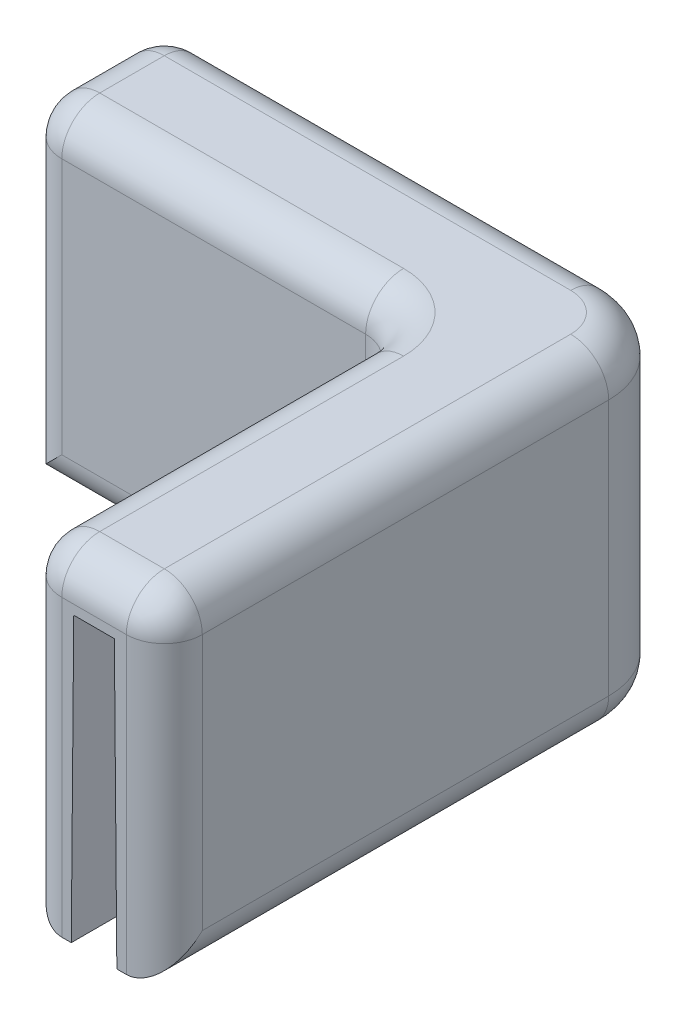
ISO-10303-21;
HEADER;
FILE_DESCRIPTION(('STEP AP214'),'2;1');
FILE_NAME('part.step','',(''),(''),'','','');
FILE_SCHEMA(('AUTOMOTIVE_DESIGN { 1 0 10303 214 1 1 1 1 }'));
ENDSEC;
DATA;
#1=APPLICATION_CONTEXT('core data for automotive mechanical design processes');
#2=APPLICATION_PROTOCOL_DEFINITION('international standard','automotive_design',2000,#1);
#3=PRODUCT_CONTEXT('',#1,'mechanical');
#4=PRODUCT('Part','Part','',(#3));
#5=PRODUCT_RELATED_PRODUCT_CATEGORY('part','',(#4));
#6=PRODUCT_DEFINITION_FORMATION('','',#4);
#7=PRODUCT_DEFINITION_CONTEXT('part definition',#1,'design');
#8=PRODUCT_DEFINITION('design','',#6,#7);
#9=PRODUCT_DEFINITION_SHAPE('','',#8);
#10=(LENGTH_UNIT() NAMED_UNIT(*) SI_UNIT(.MILLI.,.METRE.));
#11=(NAMED_UNIT(*) PLANE_ANGLE_UNIT() SI_UNIT($,.RADIAN.));
#12=(NAMED_UNIT(*) SI_UNIT($,.STERADIAN.) SOLID_ANGLE_UNIT());
#13=UNCERTAINTY_MEASURE_WITH_UNIT(LENGTH_MEASURE(1.E-05),#10,'distance_accuracy_value','');
#14=(GEOMETRIC_REPRESENTATION_CONTEXT(3) GLOBAL_UNCERTAINTY_ASSIGNED_CONTEXT((#13)) GLOBAL_UNIT_ASSIGNED_CONTEXT((#10,
#11,#12)) REPRESENTATION_CONTEXT('',''));
#15=CARTESIAN_POINT('',(0.,0.,0.));
#16=DIRECTION('',(0.,0.,1.));
#17=DIRECTION('',(1.,0.,0.));
#18=AXIS2_PLACEMENT_3D('',#15,#16,#17);
#19=CARTESIAN_POINT('',(0.,0.,0.));
#20=DIRECTION('',(0.,-1.,0.));
#21=DIRECTION('',(0.,0.,-1.));
#22=AXIS2_PLACEMENT_3D('',#19,#20,#21);
#23=PLANE('',#22);
#24=CARTESIAN_POINT('',(-5.08,0.,5.08));
#25=DIRECTION('',(0.,-1.,0.));
#26=DIRECTION('',(0.,0.,-1.));
#27=AXIS2_PLACEMENT_3D('',#24,#25,#26);
#28=CIRCLE('',#27,2.54);
#29=CARTESIAN_POINT('',(-3.17499999999994,0.,3.39994791747405));
#30=VERTEX_POINT('',#29);
#31=CARTESIAN_POINT('',(-2.54,0.,5.08));
#32=VERTEX_POINT('',#31);
#33=EDGE_CURVE('E310',#30,#32,#28,.T.);
#34=ORIENTED_EDGE('',*,*,#33,.T.);
#35=DIRECTION('',(0.,0.,-1.));
#36=VECTOR('',#35,1.);
#37=CARTESIAN_POINT('',(-2.53999999999999,0.,34.798));
#38=LINE('',#37,#36);
#39=CARTESIAN_POINT('',(-2.53999999999999,0.,34.798));
#40=VERTEX_POINT('',#39);
#41=EDGE_CURVE('E312',#32,#40,#38,.F.);
#42=ORIENTED_EDGE('',*,*,#41,.T.);
#43=DIRECTION('',(1.,0.,0.));
#44=VECTOR('',#43,1.);
#45=CARTESIAN_POINT('',(0.,0.,34.798));
#46=LINE('',#45,#44);
#47=CARTESIAN_POINT('',(-3.17499999999994,0.,34.798));
#48=VERTEX_POINT('',#47);
#49=EDGE_CURVE('E257',#48,#40,#46,.T.);
#50=ORIENTED_EDGE('',*,*,#49,.F.);
#51=DIRECTION('',(0.,0.,1.));
#52=VECTOR('',#51,1.);
#53=CARTESIAN_POINT('',(-3.17499999999994,0.,3.175));
#54=LINE('',#53,#52);
#55=EDGE_CURVE('E241',#30,#48,#54,.T.);
#56=ORIENTED_EDGE('',*,*,#55,.F.);
#57=EDGE_LOOP('',(#34,#42,#50,#56));
#58=FACE_BOUND('',#57,.T.);
#59=ADVANCED_FACE('F37',(#58),#23,.T.);
#60=DIRECTION('',(-1.,0.,0.));
#61=VECTOR('',#60,1.);
#62=CARTESIAN_POINT('',(-5.08,0.,2.54));
#63=LINE('',#62,#61);
#64=CARTESIAN_POINT('',(-34.798,0.,2.54));
#65=VERTEX_POINT('',#64);
#66=CARTESIAN_POINT('',(-5.08,0.,2.54));
#67=VERTEX_POINT('',#66);
#68=EDGE_CURVE('E306',#65,#67,#63,.F.);
#69=ORIENTED_EDGE('',*,*,#68,.T.);
#70=CARTESIAN_POINT('',(-5.08,0.,5.08));
#71=DIRECTION('',(0.,-1.,0.));
#72=DIRECTION('',(0.,0.,-1.));
#73=AXIS2_PLACEMENT_3D('',#70,#71,#72);
#74=CIRCLE('',#73,2.54);
#75=CARTESIAN_POINT('',(-3.39994791747399,0.,3.175));
#76=VERTEX_POINT('',#75);
#77=EDGE_CURVE('E308',#67,#76,#74,.T.);
#78=ORIENTED_EDGE('',*,*,#77,.T.);
#79=DIRECTION('',(1.,0.,0.));
#80=VECTOR('',#79,1.);
#81=CARTESIAN_POINT('',(0.,0.,3.175));
#82=LINE('',#81,#80);
#83=CARTESIAN_POINT('',(-34.798,0.,3.175));
#84=VERTEX_POINT('',#83);
#85=EDGE_CURVE('E263',#84,#76,#82,.T.);
#86=ORIENTED_EDGE('',*,*,#85,.F.);
#87=DIRECTION('',(0.,0.,1.));
#88=VECTOR('',#87,1.);
#89=CARTESIAN_POINT('',(-34.798,0.,9.39800000000001));
#90=LINE('',#89,#88);
#91=EDGE_CURVE('E255',#65,#84,#90,.T.);
#92=ORIENTED_EDGE('',*,*,#91,.F.);
#93=EDGE_LOOP('',(#69,#78,#86,#92));
#94=FACE_BOUND('',#93,.T.);
#95=ADVANCED_FACE('F347',(#94),#23,.T.);
#96=CARTESIAN_POINT('',(-34.798,22.225,9.39800000000001));
#97=DIRECTION('',(1.,0.,0.));
#98=DIRECTION('',(0.,0.,-1.));
#99=AXIS2_PLACEMENT_3D('',#96,#97,#98);
#100=PLANE('',#99);
#101=CARTESIAN_POINT('',(-34.798,0.,6.223));
#102=VERTEX_POINT('',#101);
#103=CARTESIAN_POINT('',(-34.798,0.,6.85800000000001));
#104=VERTEX_POINT('',#103);
#105=EDGE_CURVE('E254',#102,#104,#90,.T.);
#106=ORIENTED_EDGE('',*,*,#105,.T.);
#107=DIRECTION('',(0.,-1.,0.));
#108=VECTOR('',#107,1.);
#109=CARTESIAN_POINT('',(-34.798,22.225,6.85800000000001));
#110=LINE('',#109,#108);
#111=CARTESIAN_POINT('',(-34.798,19.685,6.85800000000001));
#112=VERTEX_POINT('',#111);
#113=EDGE_CURVE('E615',#104,#112,#110,.F.);
#114=ORIENTED_EDGE('',*,*,#113,.T.);
#115=DIRECTION('',(0.,0.,1.));
#116=VECTOR('',#115,1.);
#117=CARTESIAN_POINT('',(-34.798,19.685,9.39800000000001));
#118=LINE('',#117,#116);
#119=CARTESIAN_POINT('',(-34.798,19.685,2.54));
#120=VERTEX_POINT('',#119);
#121=EDGE_CURVE('E611',#112,#120,#118,.F.);
#122=ORIENTED_EDGE('',*,*,#121,.T.);
#123=DIRECTION('',(0.,-1.,0.));
#124=VECTOR('',#123,1.);
#125=CARTESIAN_POINT('',(-34.798,22.225,2.54));
#126=LINE('',#125,#124);
#127=EDGE_CURVE('E613',#120,#65,#126,.T.);
#128=ORIENTED_EDGE('',*,*,#127,.T.);
#129=ORIENTED_EDGE('',*,*,#91,.T.);
#130=DIRECTION('',(0.,0.999961923064171,0.00872653549837395));
#131=VECTOR('',#130,1.);
#132=CARTESIAN_POINT('',(-34.798,22.277610675055,3.3694137630552));
#133=LINE('',#132,#131);
#134=CARTESIAN_POINT('',(-34.798,19.05,3.34124683141395));
#135=VERTEX_POINT('',#134);
#136=EDGE_CURVE('E250',#84,#135,#133,.T.);
#137=ORIENTED_EDGE('',*,*,#136,.T.);
#138=DIRECTION('',(0.,0.,-1.));
#139=VECTOR('',#138,1.);
#140=CARTESIAN_POINT('',(-34.798,19.05,9.39800000000001));
#141=LINE('',#140,#139);
#142=CARTESIAN_POINT('',(-34.798,19.05,6.05675316858604));
#143=VERTEX_POINT('',#142);
#144=EDGE_CURVE('E217',#143,#135,#141,.T.);
#145=ORIENTED_EDGE('',*,*,#144,.F.);
#146=DIRECTION('',(0.,-0.999961923064171,0.00872653549837395));
#147=VECTOR('',#146,1.);
#148=CARTESIAN_POINT('',(-34.798,22.1956018172062,6.02930191740491));
#149=LINE('',#148,#147);
#150=EDGE_CURVE('E247',#143,#102,#149,.T.);
#151=ORIENTED_EDGE('',*,*,#150,.T.);
#152=EDGE_LOOP('',(#106,#114,#122,#128,#129,#137,#145,#151));
#153=FACE_BOUND('',#152,.T.);
#154=ADVANCED_FACE('F365',(#153),#100,.F.);
#155=CARTESIAN_POINT('',(-9.39800000000001,22.225,9.398));
#156=DIRECTION('',(0.,0.,-1.));
#157=DIRECTION('',(-1.,0.,0.));
#158=AXIS2_PLACEMENT_3D('',#155,#156,#157);
#159=PLANE('',#158);
#160=DIRECTION('',(1.,0.,0.));
#161=VECTOR('',#160,1.);
#162=CARTESIAN_POINT('',(-9.39800000000001,19.685,9.398));
#163=LINE('',#162,#161);
#164=CARTESIAN_POINT('',(-11.938,19.685,9.398));
#165=VERTEX_POINT('',#164);
#166=CARTESIAN_POINT('',(-32.258,19.685,9.39800000000001));
#167=VERTEX_POINT('',#166);
#168=EDGE_CURVE('E606',#165,#167,#163,.F.);
#169=ORIENTED_EDGE('',*,*,#168,.T.);
#170=DIRECTION('',(0.,-1.,0.));
#171=VECTOR('',#170,1.);
#172=CARTESIAN_POINT('',(-32.258,22.225,9.39800000000001));
#173=LINE('',#172,#171);
#174=CARTESIAN_POINT('',(-32.258,2.54,9.39800000000001));
#175=VERTEX_POINT('',#174);
#176=EDGE_CURVE('E608',#167,#175,#173,.T.);
#177=ORIENTED_EDGE('',*,*,#176,.T.);
#178=DIRECTION('',(1.,0.,0.));
#179=VECTOR('',#178,1.);
#180=CARTESIAN_POINT('',(-9.39800000000001,2.54,9.398));
#181=LINE('',#180,#179);
#182=CARTESIAN_POINT('',(-11.938,2.54,9.398));
#183=VERTEX_POINT('',#182);
#184=EDGE_CURVE('E602',#175,#183,#181,.T.);
#185=ORIENTED_EDGE('',*,*,#184,.T.);
#186=DIRECTION('',(0.,-1.,0.));
#187=VECTOR('',#186,1.);
#188=CARTESIAN_POINT('',(-11.938,22.225,9.398));
#189=LINE('',#188,#187);
#190=EDGE_CURVE('E604',#183,#165,#189,.F.);
#191=ORIENTED_EDGE('',*,*,#190,.T.);
#192=EDGE_LOOP('',(#169,#177,#185,#191));
#193=FACE_BOUND('',#192,.T.);
#194=ADVANCED_FACE('F361',(#193),#159,.F.);
#195=CARTESIAN_POINT('',(-9.398,22.225,34.798));
#196=DIRECTION('',(1.,0.,0.));
#197=DIRECTION('',(0.,0.,-1.));
#198=AXIS2_PLACEMENT_3D('',#195,#196,#197);
#199=PLANE('',#198);
#200=DIRECTION('',(0.,-1.,0.));
#201=VECTOR('',#200,1.);
#202=CARTESIAN_POINT('',(-9.39800000000001,0.,11.938));
#203=LINE('',#202,#201);
#204=CARTESIAN_POINT('',(-9.39800000000001,19.685,11.938));
#205=VERTEX_POINT('',#204);
#206=CARTESIAN_POINT('',(-9.39800000000001,2.54,11.938));
#207=VERTEX_POINT('',#206);
#208=EDGE_CURVE('E286',#205,#207,#203,.T.);
#209=ORIENTED_EDGE('',*,*,#208,.T.);
#210=DIRECTION('',(0.,0.,1.));
#211=VECTOR('',#210,1.);
#212=CARTESIAN_POINT('',(-9.398,2.54,34.798));
#213=LINE('',#212,#211);
#214=CARTESIAN_POINT('',(-9.398,2.54,32.258));
#215=VERTEX_POINT('',#214);
#216=EDGE_CURVE('E288',#207,#215,#213,.T.);
#217=ORIENTED_EDGE('',*,*,#216,.T.);
#218=DIRECTION('',(0.,-1.,0.));
#219=VECTOR('',#218,1.);
#220=CARTESIAN_POINT('',(-9.398,22.225,32.258));
#221=LINE('',#220,#219);
#222=CARTESIAN_POINT('',(-9.398,19.685,32.258));
#223=VERTEX_POINT('',#222);
#224=EDGE_CURVE('E284',#215,#223,#221,.F.);
#225=ORIENTED_EDGE('',*,*,#224,.T.);
#226=DIRECTION('',(0.,0.,1.));
#227=VECTOR('',#226,1.);
#228=CARTESIAN_POINT('',(-9.398,19.685,34.798));
#229=LINE('',#228,#227);
#230=EDGE_CURVE('E282',#223,#205,#229,.F.);
#231=ORIENTED_EDGE('',*,*,#230,.T.);
#232=EDGE_LOOP('',(#209,#217,#225,#231));
#233=FACE_BOUND('',#232,.T.);
#234=ADVANCED_FACE('F358',(#233),#199,.F.);
#235=CARTESIAN_POINT('',(0.,22.225,34.798));
#236=DIRECTION('',(0.,0.,-1.));
#237=DIRECTION('',(-1.,0.,0.));
#238=AXIS2_PLACEMENT_3D('',#235,#236,#237);
#239=PLANE('',#238);
#240=ORIENTED_EDGE('',*,*,#49,.T.);
#241=DIRECTION('',(0.,-1.,0.));
#242=VECTOR('',#241,1.);
#243=CARTESIAN_POINT('',(-2.53999999999999,22.225,34.798));
#244=LINE('',#243,#242);
#245=CARTESIAN_POINT('',(-2.53999999999999,19.685,34.798));
#246=VERTEX_POINT('',#245);
#247=EDGE_CURVE('E11',#40,#246,#244,.F.);
#248=ORIENTED_EDGE('',*,*,#247,.T.);
#249=DIRECTION('',(1.,0.,0.));
#250=VECTOR('',#249,1.);
#251=CARTESIAN_POINT('',(0.,19.685,34.798));
#252=LINE('',#251,#250);
#253=CARTESIAN_POINT('',(-6.858,19.685,34.798));
#254=VERTEX_POINT('',#253);
#255=EDGE_CURVE('E53',#246,#254,#252,.F.);
#256=ORIENTED_EDGE('',*,*,#255,.T.);
#257=DIRECTION('',(0.,-1.,0.));
#258=VECTOR('',#257,1.);
#259=CARTESIAN_POINT('',(-6.858,22.225,34.798));
#260=LINE('',#259,#258);
#261=CARTESIAN_POINT('',(-6.858,0.,34.798));
#262=VERTEX_POINT('',#261);
#263=EDGE_CURVE('E46',#254,#262,#260,.T.);
#264=ORIENTED_EDGE('',*,*,#263,.T.);
#265=CARTESIAN_POINT('',(-6.22299999999997,0.,34.798));
#266=VERTEX_POINT('',#265);
#267=EDGE_CURVE('E258',#262,#266,#46,.T.);
#268=ORIENTED_EDGE('',*,*,#267,.T.);
#269=DIRECTION('',(0.00872653549837395,0.999961923064171,0.));
#270=VECTOR('',#269,1.);
#271=CARTESIAN_POINT('',(-6.02858623694478,22.277610675055,34.798));
#272=LINE('',#271,#270);
#273=CARTESIAN_POINT('',(-6.05675316858602,19.05,34.798));
#274=VERTEX_POINT('',#273);
#275=EDGE_CURVE('E231',#266,#274,#272,.T.);
#276=ORIENTED_EDGE('',*,*,#275,.T.);
#277=DIRECTION('',(-1.,0.,0.));
#278=VECTOR('',#277,1.);
#279=CARTESIAN_POINT('',(0.,19.05,34.798));
#280=LINE('',#279,#278);
#281=CARTESIAN_POINT('',(-3.3412468314139,19.05,34.798));
#282=VERTEX_POINT('',#281);
#283=EDGE_CURVE('E265',#282,#274,#280,.T.);
#284=ORIENTED_EDGE('',*,*,#283,.F.);
#285=DIRECTION('',(0.00872653549837395,-0.999961923064171,0.));
#286=VECTOR('',#285,1.);
#287=CARTESIAN_POINT('',(-3.36869808259503,22.1956018172062,34.798));
#288=LINE('',#287,#286);
#289=EDGE_CURVE('E235',#282,#48,#288,.T.);
#290=ORIENTED_EDGE('',*,*,#289,.T.);
#291=EDGE_LOOP('',(#240,#248,#256,#264,#268,#276,#284,#290));
#292=FACE_BOUND('',#291,.T.);
#293=ADVANCED_FACE('F354',(#292),#239,.F.);
#294=CARTESIAN_POINT('',(0.,22.225,0.));
#295=DIRECTION('',(-1.,0.,0.));
#296=DIRECTION('',(0.,0.,1.));
#297=AXIS2_PLACEMENT_3D('',#294,#295,#296);
#298=PLANE('',#297);
#299=DIRECTION('',(0.,-1.,0.));
#300=VECTOR('',#299,1.);
#301=CARTESIAN_POINT('',(0.,22.225,32.258));
#302=LINE('',#301,#300);
#303=CARTESIAN_POINT('',(0.,19.685,32.258));
#304=VERTEX_POINT('',#303);
#305=CARTESIAN_POINT('',(0.,2.54,32.258));
#306=VERTEX_POINT('',#305);
#307=EDGE_CURVE('E299',#304,#306,#302,.T.);
#308=ORIENTED_EDGE('',*,*,#307,.T.);
#309=DIRECTION('',(0.,0.,-1.));
#310=VECTOR('',#309,1.);
#311=CARTESIAN_POINT('',(0.,2.54,5.08));
#312=LINE('',#311,#310);
#313=CARTESIAN_POINT('',(0.,2.54,5.08));
#314=VERTEX_POINT('',#313);
#315=EDGE_CURVE('E303',#306,#314,#312,.T.);
#316=ORIENTED_EDGE('',*,*,#315,.T.);
#317=DIRECTION('',(0.,-1.,0.));
#318=VECTOR('',#317,1.);
#319=CARTESIAN_POINT('',(0.,22.225,5.08));
#320=LINE('',#319,#318);
#321=CARTESIAN_POINT('',(0.,19.685,5.08));
#322=VERTEX_POINT('',#321);
#323=EDGE_CURVE('E270',#314,#322,#320,.F.);
#324=ORIENTED_EDGE('',*,*,#323,.T.);
#325=DIRECTION('',(0.,0.,-1.));
#326=VECTOR('',#325,1.);
#327=CARTESIAN_POINT('',(0.,19.685,0.));
#328=LINE('',#327,#326);
#329=EDGE_CURVE('E301',#322,#304,#328,.F.);
#330=ORIENTED_EDGE('',*,*,#329,.T.);
#331=EDGE_LOOP('',(#308,#316,#324,#330));
#332=FACE_BOUND('',#331,.T.);
#333=ADVANCED_FACE('F350',(#332),#298,.F.);
#334=CARTESIAN_POINT('',(-34.798,22.225,0.));
#335=DIRECTION('',(0.,0.,1.));
#336=DIRECTION('',(1.,0.,0.));
#337=AXIS2_PLACEMENT_3D('',#334,#335,#336);
#338=PLANE('',#337);
#339=DIRECTION('',(0.,-1.,0.));
#340=VECTOR('',#339,1.);
#341=CARTESIAN_POINT('',(-5.08,22.225,0.));
#342=LINE('',#341,#340);
#343=CARTESIAN_POINT('',(-5.08,19.685,0.));
#344=VERTEX_POINT('',#343);
#345=CARTESIAN_POINT('',(-5.08,2.54,0.));
#346=VERTEX_POINT('',#345);
#347=EDGE_CURVE('E267',#344,#346,#342,.T.);
#348=ORIENTED_EDGE('',*,*,#347,.T.);
#349=DIRECTION('',(-1.,0.,0.));
#350=VECTOR('',#349,1.);
#351=CARTESIAN_POINT('',(-34.798,2.54,0.));
#352=LINE('',#351,#350);
#353=CARTESIAN_POINT('',(-32.258,2.54,0.));
#354=VERTEX_POINT('',#353);
#355=EDGE_CURVE('E502',#346,#354,#352,.T.);
#356=ORIENTED_EDGE('',*,*,#355,.T.);
#357=DIRECTION('',(0.,-1.,0.));
#358=VECTOR('',#357,1.);
#359=CARTESIAN_POINT('',(-32.258,22.225,0.));
#360=LINE('',#359,#358);
#361=CARTESIAN_POINT('',(-32.258,19.685,0.));
#362=VERTEX_POINT('',#361);
#363=EDGE_CURVE('E505',#354,#362,#360,.F.);
#364=ORIENTED_EDGE('',*,*,#363,.T.);
#365=DIRECTION('',(-1.,0.,0.));
#366=VECTOR('',#365,1.);
#367=CARTESIAN_POINT('',(-34.798,19.685,0.));
#368=LINE('',#367,#366);
#369=EDGE_CURVE('E617',#362,#344,#368,.F.);
#370=ORIENTED_EDGE('',*,*,#369,.T.);
#371=EDGE_LOOP('',(#348,#356,#364,#370));
#372=FACE_BOUND('',#371,.T.);
#373=ADVANCED_FACE('F342',(#372),#338,.F.);
#374=CARTESIAN_POINT('',(0.,22.225,0.));
#375=DIRECTION('',(0.,-1.,0.));
#376=DIRECTION('',(0.,0.,-1.));
#377=AXIS2_PLACEMENT_3D('',#374,#375,#376);
#378=PLANE('',#377);
#379=CARTESIAN_POINT('',(-11.938,22.225,11.938));
#380=DIRECTION('',(0.,-1.,0.));
#381=DIRECTION('',(0.,0.,-1.));
#382=AXIS2_PLACEMENT_3D('',#379,#380,#381);
#383=CIRCLE('',#382,5.08);
#384=CARTESIAN_POINT('',(-6.858,22.225,11.938));
#385=VERTEX_POINT('',#384);
#386=CARTESIAN_POINT('',(-11.938,22.225,6.858));
#387=VERTEX_POINT('',#386);
#388=EDGE_CURVE('E597',#385,#387,#383,.F.);
#389=ORIENTED_EDGE('',*,*,#388,.F.);
#390=DIRECTION('',(0.,0.,1.));
#391=VECTOR('',#390,1.);
#392=CARTESIAN_POINT('',(-6.85800000000001,22.225,0.));
#393=LINE('',#392,#391);
#394=CARTESIAN_POINT('',(-6.858,22.225,32.258));
#395=VERTEX_POINT('',#394);
#396=EDGE_CURVE('E600',#385,#395,#393,.T.);
#397=ORIENTED_EDGE('',*,*,#396,.T.);
#398=DIRECTION('',(1.,0.,0.));
#399=VECTOR('',#398,1.);
#400=CARTESIAN_POINT('',(0.,22.225,32.258));
#401=LINE('',#400,#399);
#402=CARTESIAN_POINT('',(-2.53999999999999,22.225,32.258));
#403=VERTEX_POINT('',#402);
#404=EDGE_CURVE('E595',#395,#403,#401,.T.);
#405=ORIENTED_EDGE('',*,*,#404,.T.);
#406=DIRECTION('',(0.,0.,-1.));
#407=VECTOR('',#406,1.);
#408=CARTESIAN_POINT('',(-2.54,22.225,0.));
#409=LINE('',#408,#407);
#410=CARTESIAN_POINT('',(-2.54,22.225,5.08));
#411=VERTEX_POINT('',#410);
#412=EDGE_CURVE('E592',#403,#411,#409,.T.);
#413=ORIENTED_EDGE('',*,*,#412,.T.);
#414=CARTESIAN_POINT('',(-5.08,22.225,5.08));
#415=DIRECTION('',(0.,-1.,0.));
#416=DIRECTION('',(0.,0.,-1.));
#417=AXIS2_PLACEMENT_3D('',#414,#415,#416);
#418=CIRCLE('',#417,2.54);
#419=CARTESIAN_POINT('',(-5.08,22.225,2.54));
#420=VERTEX_POINT('',#419);
#421=EDGE_CURVE('E590',#411,#420,#418,.F.);
#422=ORIENTED_EDGE('',*,*,#421,.T.);
#423=DIRECTION('',(-1.,0.,0.));
#424=VECTOR('',#423,1.);
#425=CARTESIAN_POINT('',(0.,22.225,2.54));
#426=LINE('',#425,#424);
#427=CARTESIAN_POINT('',(-32.258,22.225,2.54));
#428=VERTEX_POINT('',#427);
#429=EDGE_CURVE('E582',#420,#428,#426,.T.);
#430=ORIENTED_EDGE('',*,*,#429,.T.);
#431=DIRECTION('',(0.,0.,1.));
#432=VECTOR('',#431,1.);
#433=CARTESIAN_POINT('',(-32.258,22.225,0.));
#434=LINE('',#433,#432);
#435=CARTESIAN_POINT('',(-32.258,22.225,6.85800000000001));
#436=VERTEX_POINT('',#435);
#437=EDGE_CURVE('E586',#428,#436,#434,.T.);
#438=ORIENTED_EDGE('',*,*,#437,.T.);
#439=DIRECTION('',(1.,0.,0.));
#440=VECTOR('',#439,1.);
#441=CARTESIAN_POINT('',(0.,22.225,6.858));
#442=LINE('',#441,#440);
#443=EDGE_CURVE('E588',#436,#387,#442,.T.);
#444=ORIENTED_EDGE('',*,*,#443,.T.);
#445=EDGE_LOOP('',(#389,#397,#405,#413,#422,#430,#438,#444));
#446=FACE_BOUND('',#445,.T.);
#447=ADVANCED_FACE('F338',(#446),#378,.F.);
#448=ORIENTED_EDGE('',*,*,#267,.F.);
#449=DIRECTION('',(0.,0.,1.));
#450=VECTOR('',#449,1.);
#451=CARTESIAN_POINT('',(-6.858,0.,9.398));
#452=LINE('',#451,#450);
#453=CARTESIAN_POINT('',(-6.858,0.,11.938));
#454=VERTEX_POINT('',#453);
#455=EDGE_CURVE('E296',#262,#454,#452,.F.);
#456=ORIENTED_EDGE('',*,*,#455,.T.);
#457=CARTESIAN_POINT('',(-11.938,0.,11.938));
#458=DIRECTION('',(0.,-1.,0.));
#459=DIRECTION('',(0.,0.,-1.));
#460=AXIS2_PLACEMENT_3D('',#457,#458,#459);
#461=CIRCLE('',#460,5.08);
#462=CARTESIAN_POINT('',(-11.938,0.,6.858));
#463=VERTEX_POINT('',#462);
#464=EDGE_CURVE('E293',#463,#454,#461,.T.);
#465=ORIENTED_EDGE('',*,*,#464,.F.);
#466=DIRECTION('',(1.,0.,0.));
#467=VECTOR('',#466,1.);
#468=CARTESIAN_POINT('',(-34.798,0.,6.85800000000001));
#469=LINE('',#468,#467);
#470=EDGE_CURVE('E291',#463,#104,#469,.F.);
#471=ORIENTED_EDGE('',*,*,#470,.T.);
#472=ORIENTED_EDGE('',*,*,#105,.F.);
#473=DIRECTION('',(-1.,0.,0.));
#474=VECTOR('',#473,1.);
#475=CARTESIAN_POINT('',(-6.22299999999997,0.,6.223));
#476=LINE('',#475,#474);
#477=CARTESIAN_POINT('',(-11.302806569166,0.,6.223));
#478=VERTEX_POINT('',#477);
#479=EDGE_CURVE('E237',#478,#102,#476,.T.);
#480=ORIENTED_EDGE('',*,*,#479,.F.);
#481=CARTESIAN_POINT('',(-11.3031934381995,0.,11.3031934381995));
#482=DIRECTION('',(0.,-1.,0.));
#483=DIRECTION('',(-0.707106781186548,0.,0.707106781186547));
#484=AXIS2_PLACEMENT_3D('',#481,#482,#483);
#485=ELLIPSE('',#484,5.08038686903383,5.08);
#486=CARTESIAN_POINT('',(-6.22299999999997,0.,11.302806569166));
#487=VERTEX_POINT('',#486);
#488=EDGE_CURVE('E276',#478,#487,#485,.T.);
#489=ORIENTED_EDGE('',*,*,#488,.T.);
#490=DIRECTION('',(0.,0.,-1.));
#491=VECTOR('',#490,1.);
#492=CARTESIAN_POINT('',(-6.22299999999997,0.,0.));
#493=LINE('',#492,#491);
#494=EDGE_CURVE('E260',#266,#487,#493,.T.);
#495=ORIENTED_EDGE('',*,*,#494,.F.);
#496=EDGE_LOOP('',(#448,#456,#465,#471,#472,#480,#489,#495));
#497=FACE_BOUND('',#496,.T.);
#498=ADVANCED_FACE('F341',(#497),#23,.T.);
#499=CARTESIAN_POINT('',(0.,19.05,0.));
#500=DIRECTION('',(0.,-1.,0.));
#501=DIRECTION('',(0.,0.,-1.));
#502=AXIS2_PLACEMENT_3D('',#499,#500,#501);
#503=PLANE('',#502);
#504=ORIENTED_EDGE('',*,*,#144,.T.);
#505=DIRECTION('',(1.,0.,0.));
#506=VECTOR('',#505,1.);
#507=CARTESIAN_POINT('',(0.,19.05,3.34124683141395));
#508=LINE('',#507,#506);
#509=CARTESIAN_POINT('',(-3.3412468314139,19.05,3.34124683141395));
#510=VERTEX_POINT('',#509);
#511=EDGE_CURVE('E210',#135,#510,#508,.T.);
#512=ORIENTED_EDGE('',*,*,#511,.T.);
#513=DIRECTION('',(0.,0.,1.));
#514=VECTOR('',#513,1.);
#515=CARTESIAN_POINT('',(-3.3412468314139,19.05,0.));
#516=LINE('',#515,#514);
#517=EDGE_CURVE('E214',#510,#282,#516,.T.);
#518=ORIENTED_EDGE('',*,*,#517,.T.);
#519=ORIENTED_EDGE('',*,*,#283,.T.);
#520=DIRECTION('',(0.,0.,-1.));
#521=VECTOR('',#520,1.);
#522=CARTESIAN_POINT('',(-6.05675316858602,19.05,0.));
#523=LINE('',#522,#521);
#524=CARTESIAN_POINT('',(-6.05675316858602,19.05,11.136559737752));
#525=VERTEX_POINT('',#524);
#526=EDGE_CURVE('E236',#274,#525,#523,.T.);
#527=ORIENTED_EDGE('',*,*,#526,.T.);
#528=CARTESIAN_POINT('',(-11.1369466067856,19.05,11.1369466067856));
#529=DIRECTION('',(0.,-1.,0.));
#530=DIRECTION('',(-0.707106781186548,0.,0.707106781186547));
#531=AXIS2_PLACEMENT_3D('',#528,#529,#530);
#532=ELLIPSE('',#531,5.08038686903383,5.08);
#533=CARTESIAN_POINT('',(-11.136559737752,19.05,6.05675316858604));
#534=VERTEX_POINT('',#533);
#535=EDGE_CURVE('E280',#525,#534,#532,.F.);
#536=ORIENTED_EDGE('',*,*,#535,.T.);
#537=DIRECTION('',(-1.,0.,0.));
#538=VECTOR('',#537,1.);
#539=CARTESIAN_POINT('',(0.,19.05,6.05675316858605));
#540=LINE('',#539,#538);
#541=EDGE_CURVE('E222',#534,#143,#540,.T.);
#542=ORIENTED_EDGE('',*,*,#541,.T.);
#543=EDGE_LOOP('',(#504,#512,#518,#519,#527,#536,#542));
#544=FACE_BOUND('',#543,.T.);
#545=ADVANCED_FACE('F212',(#544),#503,.T.);
#546=CARTESIAN_POINT('',(-3.17499999999994,0.,3.175));
#547=DIRECTION('',(0.999961923064171,0.00872653549837395,0.));
#548=DIRECTION('',(-0.00872653549837395,0.999961923064171,0.));
#549=AXIS2_PLACEMENT_3D('',#546,#547,#548);
#550=PLANE('',#549);
#551=DIRECTION('',(0.00872620324394424,-0.99992385047757,-0.00872620324394424));
#552=VECTOR('',#551,1.);
#553=CARTESIAN_POINT('',(-3.17764508926165,0.303097207970054,3.1776450892617));
#554=LINE('',#553,#552);
#555=CARTESIAN_POINT('',(-3.17504078907952,0.00467396556911833,3.17504078907958));
#556=VERTEX_POINT('',#555);
#557=EDGE_CURVE('E221',#510,#556,#554,.T.);
#558=ORIENTED_EDGE('',*,*,#557,.T.);
#559=CARTESIAN_POINT('',(-3.17504078907952,0.00467396556911833,3.17504078907958));
#560=CARTESIAN_POINT('',(-3.17502696770847,0.00309019331754149,3.21250871982403));
#561=CARTESIAN_POINT('',(-3.17501665793339,0.00190881010749754,3.24998501354154));
#562=CARTESIAN_POINT('',(-3.1750030616242,0.000350827391135925,3.32495405646038));
#563=CARTESIAN_POINT('',(-3.17499977503943,-2.5777921859462E-05,3.36244680554103));
#564=CARTESIAN_POINT('',(-3.17499999999994,0.,3.39994791747405));
#565=B_SPLINE_CURVE_WITH_KNOTS('',3,(#559,#560,#561,#562,#563,#564),.UNSPECIFIED.,.F.,.F.,(4,2,
4),(0.,0.112484733499391,0.22496865539001),.UNSPECIFIED.);
#566=EDGE_CURVE('E321',#556,#30,#565,.T.);
#567=ORIENTED_EDGE('',*,*,#566,.T.);
#568=ORIENTED_EDGE('',*,*,#55,.T.);
#569=ORIENTED_EDGE('',*,*,#289,.F.);
#570=ORIENTED_EDGE('',*,*,#517,.F.);
#571=EDGE_LOOP('',(#558,#567,#568,#569,#570));
#572=FACE_BOUND('',#571,.T.);
#573=ADVANCED_FACE('F233',(#572),#550,.F.);
#574=CARTESIAN_POINT('',(-37.9117900977744,0.,3.175));
#575=DIRECTION('',(0.,0.00872653549837395,-0.999961923064171));
#576=DIRECTION('',(0.,0.999961923064171,0.00872653549837395));
#577=AXIS2_PLACEMENT_3D('',#574,#575,#576);
#578=PLANE('',#577);
#579=ORIENTED_EDGE('',*,*,#85,.T.);
#580=CARTESIAN_POINT('',(-3.39994791747399,0.,3.175));
#581=CARTESIAN_POINT('',(-3.36244680554096,-2.57779218596884E-05,3.17499977503948));
#582=CARTESIAN_POINT('',(-3.32495405646031,0.000350827391135788,3.17500306162426));
#583=CARTESIAN_POINT('',(-3.24998501354148,0.0019088101074976,3.17501665793345));
#584=CARTESIAN_POINT('',(-3.21250871982397,0.00309019331754166,3.17502696770853));
#585=CARTESIAN_POINT('',(-3.17504078907952,0.00467396556911861,3.17504078907958));
#586=B_SPLINE_CURVE_WITH_KNOTS('',3,(#580,#581,#582,#583,#584,#585),.UNSPECIFIED.,.F.,.F.,(4,2,
4),(0.,0.112483921890613,0.22496865539),.UNSPECIFIED.);
#587=EDGE_CURVE('E228',#76,#556,#586,.T.);
#588=ORIENTED_EDGE('',*,*,#587,.T.);
#589=ORIENTED_EDGE('',*,*,#557,.F.);
#590=ORIENTED_EDGE('',*,*,#511,.F.);
#591=ORIENTED_EDGE('',*,*,#136,.F.);
#592=EDGE_LOOP('',(#579,#588,#589,#590,#591));
#593=FACE_BOUND('',#592,.T.);
#594=ADVANCED_FACE('F226',(#593),#578,.F.);
#595=CARTESIAN_POINT('',(-6.22299999999997,0.,6.223));
#596=DIRECTION('',(0.,0.00872653549837395,0.999961923064171));
#597=DIRECTION('',(0.,-0.999961923064171,0.00872653549837395));
#598=AXIS2_PLACEMENT_3D('',#595,#596,#597);
#599=PLANE('',#598);
#600=ORIENTED_EDGE('',*,*,#541,.F.);
#601=DIRECTION('',(-0.00872620324394424,-0.999923850477571,0.00872620324394424));
#602=VECTOR('',#601,1.);
#603=CARTESIAN_POINT('',(-11.30241975905,0.0443240490502546,6.22261318988399));
#604=LINE('',#603,#602);
#605=EDGE_CURVE('E273',#534,#478,#604,.T.);
#606=ORIENTED_EDGE('',*,*,#605,.T.);
#607=ORIENTED_EDGE('',*,*,#479,.T.);
#608=ORIENTED_EDGE('',*,*,#150,.F.);
#609=EDGE_LOOP('',(#600,#606,#607,#608));
#610=FACE_BOUND('',#609,.T.);
#611=ADVANCED_FACE('F336',(#610),#599,.F.);
#612=CARTESIAN_POINT('',(-6.22299999999998,0.,40.346025657233));
#613=DIRECTION('',(-0.999961923064171,0.00872653549837395,0.));
#614=DIRECTION('',(-0.00872653549837395,-0.999961923064171,0.));
#615=AXIS2_PLACEMENT_3D('',#612,#613,#614);
#616=PLANE('',#615);
#617=ORIENTED_EDGE('',*,*,#494,.T.);
#618=DIRECTION('',(-0.00872620324394424,-0.999923850477571,0.00872620324394424));
#619=VECTOR('',#618,1.);
#620=CARTESIAN_POINT('',(-6.22521154305617,-0.253417733511874,11.3050181122222));
#621=LINE('',#620,#619);
#622=EDGE_CURVE('E278',#487,#525,#621,.F.);
#623=ORIENTED_EDGE('',*,*,#622,.T.);
#624=ORIENTED_EDGE('',*,*,#526,.F.);
#625=ORIENTED_EDGE('',*,*,#275,.F.);
#626=EDGE_LOOP('',(#617,#623,#624,#625));
#627=FACE_BOUND('',#626,.T.);
#628=ADVANCED_FACE('F374',(#627),#616,.F.);
#629=CARTESIAN_POINT('',(-5.08,22.225,5.08));
#630=DIRECTION('',(0.,-1.,0.));
#631=DIRECTION('',(0.,0.,-1.));
#632=AXIS2_PLACEMENT_3D('',#629,#630,#631);
#633=CYLINDRICAL_SURFACE('',#632,5.08);
#634=ORIENTED_EDGE('',*,*,#323,.F.);
#635=CARTESIAN_POINT('',(-5.08,2.54,5.08));
#636=DIRECTION('',(0.,-1.,0.));
#637=DIRECTION('',(0.,0.,-1.));
#638=AXIS2_PLACEMENT_3D('',#635,#636,#637);
#639=CIRCLE('',#638,5.08);
#640=EDGE_CURVE('E473',#314,#346,#639,.F.);
#641=ORIENTED_EDGE('',*,*,#640,.T.);
#642=ORIENTED_EDGE('',*,*,#347,.F.);
#643=CARTESIAN_POINT('',(-5.08,19.685,5.08));
#644=DIRECTION('',(0.,-1.,0.));
#645=DIRECTION('',(0.,0.,-1.));
#646=AXIS2_PLACEMENT_3D('',#643,#644,#645);
#647=CIRCLE('',#646,5.08);
#648=EDGE_CURVE('E578',#344,#322,#647,.T.);
#649=ORIENTED_EDGE('',*,*,#648,.T.);
#650=EDGE_LOOP('',(#634,#641,#642,#649));
#651=FACE_BOUND('',#650,.T.);
#652=ADVANCED_FACE('F370',(#651),#633,.T.);
#653=CARTESIAN_POINT('',(-11.30241975905,0.0886548493819942,11.30241975905));
#654=DIRECTION('',(-0.00872620324394424,-0.99992385047757,0.00872620324394423));
#655=DIRECTION('',(0.999961923064171,-0.00872653549837395,0.));
#656=AXIS2_PLACEMENT_3D('',#653,#654,#655);
#657=CYLINDRICAL_SURFACE('',#656,5.08);
#658=ORIENTED_EDGE('',*,*,#535,.F.);
#659=ORIENTED_EDGE('',*,*,#622,.F.);
#660=ORIENTED_EDGE('',*,*,#488,.F.);
#661=ORIENTED_EDGE('',*,*,#605,.F.);
#662=EDGE_LOOP('',(#658,#659,#660,#661));
#663=FACE_BOUND('',#662,.T.);
#664=ADVANCED_FACE('F373',(#663),#657,.T.);
#665=CARTESIAN_POINT('',(-34.798,2.54,2.54));
#666=DIRECTION('',(1.,0.,0.));
#667=DIRECTION('',(0.,0.,-1.));
#668=AXIS2_PLACEMENT_3D('',#665,#666,#667);
#669=CYLINDRICAL_SURFACE('',#668,2.54);
#670=CARTESIAN_POINT('',(-5.08,2.54,2.54));
#671=DIRECTION('',(1.,0.,0.));
#672=DIRECTION('',(0.,0.,-1.));
#673=AXIS2_PLACEMENT_3D('',#670,#671,#672);
#674=CIRCLE('',#673,2.54);
#675=EDGE_CURVE('E553',#67,#346,#674,.T.);
#676=ORIENTED_EDGE('',*,*,#675,.F.);
#677=ORIENTED_EDGE('',*,*,#68,.F.);
#678=CARTESIAN_POINT('',(-32.258,2.54,2.54));
#679=DIRECTION('',(0.707106781186547,-0.707106781186547,0.));
#680=DIRECTION('',(-0.707106781186547,-0.707106781186547,0.));
#681=AXIS2_PLACEMENT_3D('',#678,#679,#680);
#682=ELLIPSE('',#681,3.59210244842766,2.54);
#683=EDGE_CURVE('E41',#354,#65,#682,.F.);
#684=ORIENTED_EDGE('',*,*,#683,.F.);
#685=ORIENTED_EDGE('',*,*,#355,.F.);
#686=EDGE_LOOP('',(#676,#677,#684,#685));
#687=FACE_BOUND('',#686,.T.);
#688=ADVANCED_FACE('F39',(#687),#669,.T.);
#689=CARTESIAN_POINT('',(-32.258,22.225,2.54));
#690=DIRECTION('',(0.,-1.,0.));
#691=DIRECTION('',(0.,0.,-1.));
#692=AXIS2_PLACEMENT_3D('',#689,#690,#691);
#693=CYLINDRICAL_SURFACE('',#692,2.54);
#694=ORIENTED_EDGE('',*,*,#683,.T.);
#695=ORIENTED_EDGE('',*,*,#127,.F.);
#696=CARTESIAN_POINT('',(-32.258,19.685,2.54));
#697=DIRECTION('',(0.,1.,0.));
#698=DIRECTION('',(0.,0.,1.));
#699=AXIS2_PLACEMENT_3D('',#696,#697,#698);
#700=CIRCLE('',#699,2.54);
#701=EDGE_CURVE('E551',#362,#120,#700,.T.);
#702=ORIENTED_EDGE('',*,*,#701,.F.);
#703=ORIENTED_EDGE('',*,*,#363,.F.);
#704=EDGE_LOOP('',(#694,#695,#702,#703));
#705=FACE_BOUND('',#704,.T.);
#706=ADVANCED_FACE('F626',(#705),#693,.T.);
#707=CARTESIAN_POINT('',(0.,19.685,2.54));
#708=DIRECTION('',(-1.,0.,0.));
#709=DIRECTION('',(0.,0.,1.));
#710=AXIS2_PLACEMENT_3D('',#707,#708,#709);
#711=CYLINDRICAL_SURFACE('',#710,2.54);
#712=CARTESIAN_POINT('',(-5.08,19.685,2.54));
#713=DIRECTION('',(1.,0.,0.));
#714=DIRECTION('',(0.,0.,-1.));
#715=AXIS2_PLACEMENT_3D('',#712,#713,#714);
#716=CIRCLE('',#715,2.54);
#717=EDGE_CURVE('E475',#344,#420,#716,.T.);
#718=ORIENTED_EDGE('',*,*,#717,.F.);
#719=ORIENTED_EDGE('',*,*,#369,.F.);
#720=CARTESIAN_POINT('',(-32.258,19.685,2.54));
#721=DIRECTION('',(-1.,0.,0.));
#722=DIRECTION('',(0.,0.,1.));
#723=AXIS2_PLACEMENT_3D('',#720,#721,#722);
#724=CIRCLE('',#723,2.54);
#725=EDGE_CURVE('E549',#428,#362,#724,.T.);
#726=ORIENTED_EDGE('',*,*,#725,.F.);
#727=ORIENTED_EDGE('',*,*,#429,.F.);
#728=EDGE_LOOP('',(#718,#719,#726,#727));
#729=FACE_BOUND('',#728,.T.);
#730=ADVANCED_FACE('F456',(#729),#711,.T.);
#731=CARTESIAN_POINT('',(-5.08,2.54,5.08));
#732=DIRECTION('',(0.,-1.,0.));
#733=DIRECTION('',(0.,0.,-1.));
#734=AXIS2_PLACEMENT_3D('',#731,#732,#733);
#735=DEGENERATE_TOROIDAL_SURFACE('',#734,2.54,2.54,.T.);
#736=ORIENTED_EDGE('',*,*,#675,.T.);
#737=ORIENTED_EDGE('',*,*,#640,.F.);
#738=CARTESIAN_POINT('',(-2.54,2.54,5.08));
#739=DIRECTION('',(0.,0.,1.));
#740=DIRECTION('',(1.,0.,0.));
#741=AXIS2_PLACEMENT_3D('',#738,#739,#740);
#742=CIRCLE('',#741,2.54);
#743=EDGE_CURVE('E471',#32,#314,#742,.T.);
#744=ORIENTED_EDGE('',*,*,#743,.F.);
#745=ORIENTED_EDGE('',*,*,#33,.F.);
#746=ORIENTED_EDGE('',*,*,#566,.F.);
#747=ORIENTED_EDGE('',*,*,#587,.F.);
#748=ORIENTED_EDGE('',*,*,#77,.F.);
#749=EDGE_LOOP('',(#736,#737,#744,#745,#746,#747,#748));
#750=FACE_BOUND('',#749,.T.);
#751=ADVANCED_FACE('F328',(#750),#735,.T.);
#752=CARTESIAN_POINT('',(-32.258,19.685,2.54));
#753=DIRECTION('',(0.,0.,1.));
#754=DIRECTION('',(1.,0.,0.));
#755=AXIS2_PLACEMENT_3D('',#752,#753,#754);
#756=SPHERICAL_SURFACE('',#755,2.54);
#757=ORIENTED_EDGE('',*,*,#725,.T.);
#758=ORIENTED_EDGE('',*,*,#701,.T.);
#759=CARTESIAN_POINT('',(-32.258,19.685,2.54));
#760=DIRECTION('',(0.,0.,-1.));
#761=DIRECTION('',(-1.,0.,0.));
#762=AXIS2_PLACEMENT_3D('',#759,#760,#761);
#763=CIRCLE('',#762,2.54);
#764=EDGE_CURVE('E476',#428,#120,#763,.F.);
#765=ORIENTED_EDGE('',*,*,#764,.F.);
#766=EDGE_LOOP('',(#757,#758,#765));
#767=FACE_BOUND('',#766,.T.);
#768=ADVANCED_FACE('F449',(#767),#756,.T.);
#769=CARTESIAN_POINT('',(-5.08,19.685,5.08));
#770=DIRECTION('',(0.,-1.,0.));
#771=DIRECTION('',(0.,0.,-1.));
#772=AXIS2_PLACEMENT_3D('',#769,#770,#771);
#773=DEGENERATE_TOROIDAL_SURFACE('',#772,2.54,2.54,.T.);
#774=ORIENTED_EDGE('',*,*,#717,.T.);
#775=ORIENTED_EDGE('',*,*,#421,.F.);
#776=CARTESIAN_POINT('',(-2.54,19.685,5.08));
#777=DIRECTION('',(0.,0.,1.));
#778=DIRECTION('',(1.,0.,0.));
#779=AXIS2_PLACEMENT_3D('',#776,#777,#778);
#780=CIRCLE('',#779,2.54);
#781=EDGE_CURVE('E482',#322,#411,#780,.T.);
#782=ORIENTED_EDGE('',*,*,#781,.F.);
#783=ORIENTED_EDGE('',*,*,#648,.F.);
#784=EDGE_LOOP('',(#774,#775,#782,#783));
#785=FACE_BOUND('',#784,.T.);
#786=ADVANCED_FACE('F446',(#785),#773,.T.);
#787=CARTESIAN_POINT('',(-2.54,2.54,0.));
#788=DIRECTION('',(0.,0.,1.));
#789=DIRECTION('',(1.,0.,0.));
#790=AXIS2_PLACEMENT_3D('',#787,#788,#789);
#791=CYLINDRICAL_SURFACE('',#790,2.54);
#792=ORIENTED_EDGE('',*,*,#743,.T.);
#793=ORIENTED_EDGE('',*,*,#315,.F.);
#794=CARTESIAN_POINT('',(-2.53999999999999,2.54,32.258));
#795=DIRECTION('',(0.,-0.707106781186547,-0.707106781186547));
#796=DIRECTION('',(0.,-0.707106781186547,0.707106781186547));
#797=AXIS2_PLACEMENT_3D('',#794,#795,#796);
#798=ELLIPSE('',#797,3.59210244842766,2.54);
#799=EDGE_CURVE('E480',#40,#306,#798,.F.);
#800=ORIENTED_EDGE('',*,*,#799,.F.);
#801=ORIENTED_EDGE('',*,*,#41,.F.);
#802=EDGE_LOOP('',(#792,#793,#800,#801));
#803=FACE_BOUND('',#802,.T.);
#804=ADVANCED_FACE('F442',(#803),#791,.T.);
#805=CARTESIAN_POINT('',(-32.258,19.685,0.));
#806=DIRECTION('',(0.,0.,1.));
#807=DIRECTION('',(1.,0.,0.));
#808=AXIS2_PLACEMENT_3D('',#805,#806,#807);
#809=CYLINDRICAL_SURFACE('',#808,2.54);
#810=ORIENTED_EDGE('',*,*,#764,.T.);
#811=ORIENTED_EDGE('',*,*,#121,.F.);
#812=CARTESIAN_POINT('',(-32.258,19.685,6.85800000000001));
#813=DIRECTION('',(0.,0.,1.));
#814=DIRECTION('',(1.,0.,0.));
#815=AXIS2_PLACEMENT_3D('',#812,#813,#814);
#816=CIRCLE('',#815,2.54);
#817=EDGE_CURVE('E483',#436,#112,#816,.T.);
#818=ORIENTED_EDGE('',*,*,#817,.F.);
#819=ORIENTED_EDGE('',*,*,#437,.F.);
#820=EDGE_LOOP('',(#810,#811,#818,#819));
#821=FACE_BOUND('',#820,.T.);
#822=ADVANCED_FACE('F438',(#821),#809,.T.);
#823=CARTESIAN_POINT('',(-2.54,19.685,0.));
#824=DIRECTION('',(0.,0.,-1.));
#825=DIRECTION('',(-1.,0.,0.));
#826=AXIS2_PLACEMENT_3D('',#823,#824,#825);
#827=CYLINDRICAL_SURFACE('',#826,2.54);
#828=ORIENTED_EDGE('',*,*,#781,.T.);
#829=ORIENTED_EDGE('',*,*,#412,.F.);
#830=CARTESIAN_POINT('',(-2.53999999999999,19.685,32.258));
#831=DIRECTION('',(0.,0.,1.));
#832=DIRECTION('',(1.,0.,0.));
#833=AXIS2_PLACEMENT_3D('',#830,#831,#832);
#834=CIRCLE('',#833,2.54);
#835=EDGE_CURVE('E490',#304,#403,#834,.T.);
#836=ORIENTED_EDGE('',*,*,#835,.F.);
#837=ORIENTED_EDGE('',*,*,#329,.F.);
#838=EDGE_LOOP('',(#828,#829,#836,#837));
#839=FACE_BOUND('',#838,.T.);
#840=ADVANCED_FACE('F434',(#839),#827,.T.);
#841=CARTESIAN_POINT('',(-2.53999999999999,22.225,32.258));
#842=DIRECTION('',(0.,-1.,0.));
#843=DIRECTION('',(0.,0.,-1.));
#844=AXIS2_PLACEMENT_3D('',#841,#842,#843);
#845=CYLINDRICAL_SURFACE('',#844,2.54);
#846=ORIENTED_EDGE('',*,*,#799,.T.);
#847=ORIENTED_EDGE('',*,*,#307,.F.);
#848=CARTESIAN_POINT('',(-2.53999999999999,19.685,32.258));
#849=DIRECTION('',(0.,1.,0.));
#850=DIRECTION('',(0.,0.,1.));
#851=AXIS2_PLACEMENT_3D('',#848,#849,#850);
#852=CIRCLE('',#851,2.54);
#853=EDGE_CURVE('E486',#246,#304,#852,.T.);
#854=ORIENTED_EDGE('',*,*,#853,.F.);
#855=ORIENTED_EDGE('',*,*,#247,.F.);
#856=EDGE_LOOP('',(#846,#847,#854,#855));
#857=FACE_BOUND('',#856,.T.);
#858=ADVANCED_FACE('F430',(#857),#845,.T.);
#859=CARTESIAN_POINT('',(-32.258,19.685,6.85800000000001));
#860=DIRECTION('',(0.,0.,1.));
#861=DIRECTION('',(1.,0.,0.));
#862=AXIS2_PLACEMENT_3D('',#859,#860,#861);
#863=SPHERICAL_SURFACE('',#862,2.54);
#864=CARTESIAN_POINT('',(-32.258,19.685,6.85800000000001));
#865=DIRECTION('',(0.,1.,0.));
#866=DIRECTION('',(0.,0.,1.));
#867=AXIS2_PLACEMENT_3D('',#864,#865,#866);
#868=CIRCLE('',#867,2.54);
#869=EDGE_CURVE('E491',#167,#112,#868,.F.);
#870=ORIENTED_EDGE('',*,*,#869,.F.);
#871=CARTESIAN_POINT('',(-32.258,19.685,6.85800000000001));
#872=DIRECTION('',(-1.,0.,0.));
#873=DIRECTION('',(0.,-1.,0.));
#874=AXIS2_PLACEMENT_3D('',#871,#872,#873);
#875=CIRCLE('',#874,2.54);
#876=EDGE_CURVE('E539',#436,#167,#875,.F.);
#877=ORIENTED_EDGE('',*,*,#876,.F.);
#878=ORIENTED_EDGE('',*,*,#817,.T.);
#879=EDGE_LOOP('',(#870,#877,#878));
#880=FACE_BOUND('',#879,.T.);
#881=ADVANCED_FACE('F426',(#880),#863,.T.);
#882=CARTESIAN_POINT('',(0.,19.685,6.858));
#883=DIRECTION('',(1.,0.,0.));
#884=DIRECTION('',(0.,0.,-1.));
#885=AXIS2_PLACEMENT_3D('',#882,#883,#884);
#886=CYLINDRICAL_SURFACE('',#885,2.54);
#887=ORIENTED_EDGE('',*,*,#876,.T.);
#888=ORIENTED_EDGE('',*,*,#168,.F.);
#889=CARTESIAN_POINT('',(-11.938,19.685,6.858));
#890=DIRECTION('',(1.,0.,0.));
#891=DIRECTION('',(0.,0.,-1.));
#892=AXIS2_PLACEMENT_3D('',#889,#890,#891);
#893=CIRCLE('',#892,2.54);
#894=EDGE_CURVE('E533',#387,#165,#893,.T.);
#895=ORIENTED_EDGE('',*,*,#894,.F.);
#896=ORIENTED_EDGE('',*,*,#443,.F.);
#897=EDGE_LOOP('',(#887,#888,#895,#896));
#898=FACE_BOUND('',#897,.T.);
#899=ADVANCED_FACE('F422',(#898),#886,.T.);
#900=CARTESIAN_POINT('',(-2.53999999999999,19.685,32.258));
#901=DIRECTION('',(0.,0.,1.));
#902=DIRECTION('',(1.,0.,0.));
#903=AXIS2_PLACEMENT_3D('',#900,#901,#902);
#904=SPHERICAL_SURFACE('',#903,2.54);
#905=ORIENTED_EDGE('',*,*,#853,.T.);
#906=ORIENTED_EDGE('',*,*,#835,.T.);
#907=CARTESIAN_POINT('',(-2.53999999999999,19.685,32.258));
#908=DIRECTION('',(1.,0.,0.));
#909=DIRECTION('',(0.,0.,-1.));
#910=AXIS2_PLACEMENT_3D('',#907,#908,#909);
#911=CIRCLE('',#910,2.54);
#912=EDGE_CURVE('E494',#246,#403,#911,.F.);
#913=ORIENTED_EDGE('',*,*,#912,.F.);
#914=EDGE_LOOP('',(#905,#906,#913));
#915=FACE_BOUND('',#914,.T.);
#916=ADVANCED_FACE('F418',(#915),#904,.T.);
#917=CARTESIAN_POINT('',(-32.258,22.225,6.85800000000001));
#918=DIRECTION('',(0.,-1.,0.));
#919=DIRECTION('',(0.,0.,-1.));
#920=AXIS2_PLACEMENT_3D('',#917,#918,#919);
#921=CYLINDRICAL_SURFACE('',#920,2.54);
#922=ORIENTED_EDGE('',*,*,#869,.T.);
#923=ORIENTED_EDGE('',*,*,#113,.F.);
#924=CARTESIAN_POINT('',(-32.258,2.54,6.85800000000001));
#925=DIRECTION('',(-0.707106781186547,0.707106781186547,0.));
#926=DIRECTION('',(-0.707106781186547,-0.707106781186547,0.));
#927=AXIS2_PLACEMENT_3D('',#924,#925,#926);
#928=ELLIPSE('',#927,3.59210244842766,2.54);
#929=EDGE_CURVE('E497',#175,#104,#928,.F.);
#930=ORIENTED_EDGE('',*,*,#929,.F.);
#931=ORIENTED_EDGE('',*,*,#176,.F.);
#932=EDGE_LOOP('',(#922,#923,#930,#931));
#933=FACE_BOUND('',#932,.T.);
#934=ADVANCED_FACE('F414',(#933),#921,.T.);
#935=CARTESIAN_POINT('',(-11.938,19.685,11.938));
#936=DIRECTION('',(0.,-1.,0.));
#937=DIRECTION('',(0.,0.,-1.));
#938=AXIS2_PLACEMENT_3D('',#935,#936,#937);
#939=TOROIDAL_SURFACE('',#938,5.08,2.54);
#940=CARTESIAN_POINT('',(-11.938,19.685,11.938));
#941=DIRECTION('',(0.,-1.,0.));
#942=DIRECTION('',(0.,0.,-1.));
#943=AXIS2_PLACEMENT_3D('',#940,#941,#942);
#944=CIRCLE('',#943,2.54);
#945=EDGE_CURVE('E526',#205,#165,#944,.F.);
#946=ORIENTED_EDGE('',*,*,#945,.F.);
#947=CARTESIAN_POINT('',(-6.858,19.685,11.938));
#948=DIRECTION('',(0.,0.,-1.));
#949=DIRECTION('',(-1.,0.,0.));
#950=AXIS2_PLACEMENT_3D('',#947,#948,#949);
#951=CIRCLE('',#950,2.54);
#952=EDGE_CURVE('E496',#385,#205,#951,.F.);
#953=ORIENTED_EDGE('',*,*,#952,.F.);
#954=ORIENTED_EDGE('',*,*,#388,.T.);
#955=ORIENTED_EDGE('',*,*,#894,.T.);
#956=EDGE_LOOP('',(#946,#953,#954,#955));
#957=FACE_BOUND('',#956,.T.);
#958=ADVANCED_FACE('F410',(#957),#939,.T.);
#959=CARTESIAN_POINT('',(-6.85800000000001,19.685,0.));
#960=DIRECTION('',(0.,0.,1.));
#961=DIRECTION('',(1.,0.,0.));
#962=AXIS2_PLACEMENT_3D('',#959,#960,#961);
#963=CYLINDRICAL_SURFACE('',#962,2.54);
#964=ORIENTED_EDGE('',*,*,#952,.T.);
#965=ORIENTED_EDGE('',*,*,#230,.F.);
#966=CARTESIAN_POINT('',(-6.858,19.685,32.258));
#967=DIRECTION('',(0.,0.,1.));
#968=DIRECTION('',(1.,0.,0.));
#969=AXIS2_PLACEMENT_3D('',#966,#967,#968);
#970=CIRCLE('',#969,2.54);
#971=EDGE_CURVE('E523',#395,#223,#970,.T.);
#972=ORIENTED_EDGE('',*,*,#971,.F.);
#973=ORIENTED_EDGE('',*,*,#396,.F.);
#974=EDGE_LOOP('',(#964,#965,#972,#973));
#975=FACE_BOUND('',#974,.T.);
#976=ADVANCED_FACE('F406',(#975),#963,.T.);
#977=CARTESIAN_POINT('',(0.,19.685,32.258));
#978=DIRECTION('',(1.,0.,0.));
#979=DIRECTION('',(0.,0.,-1.));
#980=AXIS2_PLACEMENT_3D('',#977,#978,#979);
#981=CYLINDRICAL_SURFACE('',#980,2.54);
#982=ORIENTED_EDGE('',*,*,#912,.T.);
#983=ORIENTED_EDGE('',*,*,#404,.F.);
#984=CARTESIAN_POINT('',(-6.858,19.685,32.258));
#985=DIRECTION('',(-1.,0.,0.));
#986=DIRECTION('',(0.,0.,1.));
#987=AXIS2_PLACEMENT_3D('',#984,#985,#986);
#988=CIRCLE('',#987,2.54);
#989=EDGE_CURVE('E500',#254,#395,#988,.T.);
#990=ORIENTED_EDGE('',*,*,#989,.F.);
#991=ORIENTED_EDGE('',*,*,#255,.F.);
#992=EDGE_LOOP('',(#982,#983,#990,#991));
#993=FACE_BOUND('',#992,.T.);
#994=ADVANCED_FACE('F402',(#993),#981,.T.);
#995=CARTESIAN_POINT('',(-9.39800000000001,2.54,6.858));
#996=DIRECTION('',(-1.,0.,0.));
#997=DIRECTION('',(0.,0.,1.));
#998=AXIS2_PLACEMENT_3D('',#995,#996,#997);
#999=CYLINDRICAL_SURFACE('',#998,2.54);
#1000=ORIENTED_EDGE('',*,*,#929,.T.);
#1001=ORIENTED_EDGE('',*,*,#470,.F.);
#1002=CARTESIAN_POINT('',(-11.938,2.54,6.858));
#1003=DIRECTION('',(1.,0.,0.));
#1004=DIRECTION('',(0.,0.,-1.));
#1005=AXIS2_PLACEMENT_3D('',#1002,#1003,#1004);
#1006=CIRCLE('',#1005,2.54);
#1007=EDGE_CURVE('E519',#183,#463,#1006,.T.);
#1008=ORIENTED_EDGE('',*,*,#1007,.F.);
#1009=ORIENTED_EDGE('',*,*,#184,.F.);
#1010=EDGE_LOOP('',(#1000,#1001,#1008,#1009));
#1011=FACE_BOUND('',#1010,.T.);
#1012=ADVANCED_FACE('F398',(#1011),#999,.T.);
#1013=CARTESIAN_POINT('',(-11.938,22.225,11.938));
#1014=DIRECTION('',(0.,1.,0.));
#1015=DIRECTION('',(0.,0.,1.));
#1016=AXIS2_PLACEMENT_3D('',#1013,#1014,#1015);
#1017=CYLINDRICAL_SURFACE('',#1016,2.54);
#1018=ORIENTED_EDGE('',*,*,#945,.T.);
#1019=ORIENTED_EDGE('',*,*,#190,.F.);
#1020=CARTESIAN_POINT('',(-11.938,2.54,11.938));
#1021=DIRECTION('',(0.,-1.,0.));
#1022=DIRECTION('',(0.,0.,-1.));
#1023=AXIS2_PLACEMENT_3D('',#1020,#1021,#1022);
#1024=CIRCLE('',#1023,2.54);
#1025=EDGE_CURVE('E516',#207,#183,#1024,.F.);
#1026=ORIENTED_EDGE('',*,*,#1025,.F.);
#1027=ORIENTED_EDGE('',*,*,#208,.F.);
#1028=EDGE_LOOP('',(#1018,#1019,#1026,#1027));
#1029=FACE_BOUND('',#1028,.T.);
#1030=ADVANCED_FACE('F394',(#1029),#1017,.F.);
#1031=CARTESIAN_POINT('',(-6.858,19.685,32.258));
#1032=DIRECTION('',(0.,0.,1.));
#1033=DIRECTION('',(1.,0.,0.));
#1034=AXIS2_PLACEMENT_3D('',#1031,#1032,#1033);
#1035=SPHERICAL_SURFACE('',#1034,2.54);
#1036=ORIENTED_EDGE('',*,*,#989,.T.);
#1037=ORIENTED_EDGE('',*,*,#971,.T.);
#1038=CARTESIAN_POINT('',(-6.858,19.685,32.258));
#1039=DIRECTION('',(0.,1.,0.));
#1040=DIRECTION('',(0.,0.,1.));
#1041=AXIS2_PLACEMENT_3D('',#1038,#1039,#1040);
#1042=CIRCLE('',#1041,2.54);
#1043=EDGE_CURVE('E513',#254,#223,#1042,.F.);
#1044=ORIENTED_EDGE('',*,*,#1043,.F.);
#1045=EDGE_LOOP('',(#1036,#1037,#1044));
#1046=FACE_BOUND('',#1045,.T.);
#1047=ADVANCED_FACE('F390',(#1046),#1035,.T.);
#1048=CARTESIAN_POINT('',(-11.938,2.54,11.938));
#1049=DIRECTION('',(0.,-1.,0.));
#1050=DIRECTION('',(0.,0.,-1.));
#1051=AXIS2_PLACEMENT_3D('',#1048,#1049,#1050);
#1052=TOROIDAL_SURFACE('',#1051,5.08,2.54);
#1053=ORIENTED_EDGE('',*,*,#1007,.T.);
#1054=ORIENTED_EDGE('',*,*,#464,.T.);
#1055=CARTESIAN_POINT('',(-6.858,2.54,11.938));
#1056=DIRECTION('',(0.,0.,-1.));
#1057=DIRECTION('',(-1.,0.,0.));
#1058=AXIS2_PLACEMENT_3D('',#1055,#1056,#1057);
#1059=CIRCLE('',#1058,2.54);
#1060=EDGE_CURVE('E511',#207,#454,#1059,.F.);
#1061=ORIENTED_EDGE('',*,*,#1060,.F.);
#1062=ORIENTED_EDGE('',*,*,#1025,.T.);
#1063=EDGE_LOOP('',(#1053,#1054,#1061,#1062));
#1064=FACE_BOUND('',#1063,.T.);
#1065=ADVANCED_FACE('F386',(#1064),#1052,.T.);
#1066=CARTESIAN_POINT('',(-6.858,22.225,32.258));
#1067=DIRECTION('',(0.,-1.,0.));
#1068=DIRECTION('',(0.,0.,-1.));
#1069=AXIS2_PLACEMENT_3D('',#1066,#1067,#1068);
#1070=CYLINDRICAL_SURFACE('',#1069,2.54);
#1071=ORIENTED_EDGE('',*,*,#1043,.T.);
#1072=ORIENTED_EDGE('',*,*,#224,.F.);
#1073=CARTESIAN_POINT('',(-6.858,2.54,32.258));
#1074=DIRECTION('',(0.,-0.707106781186547,-0.707106781186547));
#1075=DIRECTION('',(0.,-0.707106781186547,0.707106781186547));
#1076=AXIS2_PLACEMENT_3D('',#1073,#1074,#1075);
#1077=ELLIPSE('',#1076,3.59210244842766,2.54);
#1078=EDGE_CURVE('E509',#262,#215,#1077,.T.);
#1079=ORIENTED_EDGE('',*,*,#1078,.F.);
#1080=ORIENTED_EDGE('',*,*,#263,.F.);
#1081=EDGE_LOOP('',(#1071,#1072,#1079,#1080));
#1082=FACE_BOUND('',#1081,.T.);
#1083=ADVANCED_FACE('F382',(#1082),#1070,.T.);
#1084=CARTESIAN_POINT('',(-6.858,2.54,34.798));
#1085=DIRECTION('',(0.,0.,-1.));
#1086=DIRECTION('',(-1.,0.,0.));
#1087=AXIS2_PLACEMENT_3D('',#1084,#1085,#1086);
#1088=CYLINDRICAL_SURFACE('',#1087,2.54);
#1089=ORIENTED_EDGE('',*,*,#1060,.T.);
#1090=ORIENTED_EDGE('',*,*,#455,.F.);
#1091=ORIENTED_EDGE('',*,*,#1078,.T.);
#1092=ORIENTED_EDGE('',*,*,#216,.F.);
#1093=EDGE_LOOP('',(#1089,#1090,#1091,#1092));
#1094=FACE_BOUND('',#1093,.T.);
#1095=ADVANCED_FACE('F379',(#1094),#1088,.T.);
#1096=CLOSED_SHELL('',(#59,#95,#154,#194,#234,#293,#333,#373,#447,#498,#545,#573,#594,#611,#628,
#652,#664,#688,#706,#730,#751,#768,#786,#804,#822,#840,#858,#881,#899,#916,#934,#958,#976,#994,
#1012,#1030,#1047,#1065,#1083,#1095));
#1097=MANIFOLD_SOLID_BREP('B2',#1096);
#1098=ADVANCED_BREP_SHAPE_REPRESENTATION('',(#18,#1097),#14);
#1099=SHAPE_DEFINITION_REPRESENTATION(#9,#1098);
ENDSEC;
END-ISO-10303-21;
